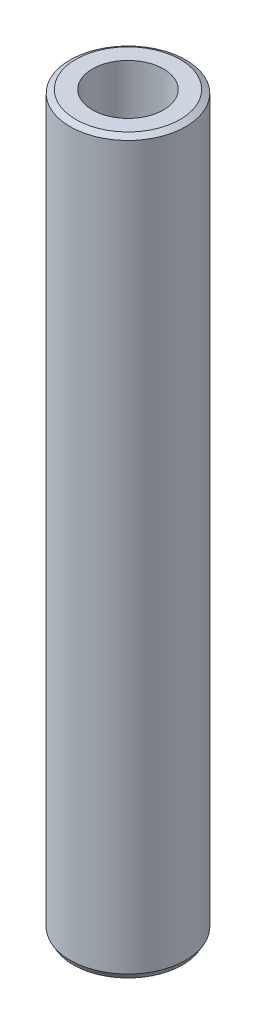
ISO-10303-21;
HEADER;
FILE_DESCRIPTION(('STEP AP214'),'2;1');
FILE_NAME('part.step','',(''),(''),'','','');
FILE_SCHEMA(('AUTOMOTIVE_DESIGN { 1 0 10303 214 1 1 1 1 }'));
ENDSEC;
DATA;
#1=APPLICATION_CONTEXT('core data for automotive mechanical design processes');
#2=APPLICATION_PROTOCOL_DEFINITION('international standard','automotive_design',2000,#1);
#3=PRODUCT_CONTEXT('',#1,'mechanical');
#4=PRODUCT('Part','Part','',(#3));
#5=PRODUCT_RELATED_PRODUCT_CATEGORY('part','',(#4));
#6=PRODUCT_DEFINITION_FORMATION('','',#4);
#7=PRODUCT_DEFINITION_CONTEXT('part definition',#1,'design');
#8=PRODUCT_DEFINITION('design','',#6,#7);
#9=PRODUCT_DEFINITION_SHAPE('','',#8);
#10=(LENGTH_UNIT() NAMED_UNIT(*) SI_UNIT(.MILLI.,.METRE.));
#11=(NAMED_UNIT(*) PLANE_ANGLE_UNIT() SI_UNIT($,.RADIAN.));
#12=(NAMED_UNIT(*) SI_UNIT($,.STERADIAN.) SOLID_ANGLE_UNIT());
#13=UNCERTAINTY_MEASURE_WITH_UNIT(LENGTH_MEASURE(1.E-05),#10,'distance_accuracy_value','');
#14=(GEOMETRIC_REPRESENTATION_CONTEXT(3) GLOBAL_UNCERTAINTY_ASSIGNED_CONTEXT((#13)) GLOBAL_UNIT_ASSIGNED_CONTEXT((#10,
#11,#12)) REPRESENTATION_CONTEXT('',''));
#15=CARTESIAN_POINT('',(0.,0.,0.));
#16=DIRECTION('',(0.,0.,1.));
#17=DIRECTION('',(1.,0.,0.));
#18=AXIS2_PLACEMENT_3D('',#15,#16,#17);
#19=CARTESIAN_POINT('',(0.,600.,0.));
#20=DIRECTION('',(0.,-1.,0.));
#21=DIRECTION('',(0.,0.,-1.));
#22=AXIS2_PLACEMENT_3D('',#19,#20,#21);
#23=CYLINDRICAL_SURFACE('',#22,47.5);
#24=CARTESIAN_POINT('',(0.,597.283650292366,0.));
#25=DIRECTION('',(0.,1.,0.));
#26=DIRECTION('',(0.,0.,1.));
#27=AXIS2_PLACEMENT_3D('',#24,#25,#26);
#28=CIRCLE('',#27,47.5);
#29=CARTESIAN_POINT('',(0.,597.283650292366,47.5));
#30=VERTEX_POINT('',#29);
#31=EDGE_CURVE('E50',#30,#30,#28,.F.);
#32=ORIENTED_EDGE('',*,*,#31,.T.);
#33=EDGE_LOOP('',(#32));
#34=FACE_BOUND('',#33,.T.);
#35=CARTESIAN_POINT('',(0.,4.7048557047471,0.));
#36=DIRECTION('',(0.,1.,0.));
#37=DIRECTION('',(0.,0.,1.));
#38=AXIS2_PLACEMENT_3D('',#35,#36,#37);
#39=CIRCLE('',#38,47.5);
#40=CARTESIAN_POINT('',(0.,4.7048557047471,47.5));
#41=VERTEX_POINT('',#40);
#42=EDGE_CURVE('E51',#41,#41,#39,.T.);
#43=ORIENTED_EDGE('',*,*,#42,.T.);
#44=EDGE_LOOP('',(#43));
#45=FACE_BOUND('',#44,.T.);
#46=ADVANCED_FACE('F39',(#34,#45),#23,.T.);
#47=CARTESIAN_POINT('',(0.,600.,0.));
#48=DIRECTION('',(0.,1.,0.));
#49=DIRECTION('',(0.,0.,1.));
#50=AXIS2_PLACEMENT_3D('',#47,#48,#49);
#51=PLANE('',#50);
#52=CARTESIAN_POINT('',(0.,600.,0.));
#53=DIRECTION('',(0.,1.,0.));
#54=DIRECTION('',(0.,0.,1.));
#55=AXIS2_PLACEMENT_3D('',#52,#53,#54);
#56=CIRCLE('',#55,42.7951442952524);
#57=CARTESIAN_POINT('',(0.,600.,42.7951442952524));
#58=VERTEX_POINT('',#57);
#59=EDGE_CURVE('E54',#58,#58,#56,.T.);
#60=ORIENTED_EDGE('',*,*,#59,.T.);
#61=EDGE_LOOP('',(#60));
#62=FACE_BOUND('',#61,.T.);
#63=CARTESIAN_POINT('',(0.,600.,0.));
#64=DIRECTION('',(0.,1.,0.));
#65=DIRECTION('',(0.,0.,1.));
#66=AXIS2_PLACEMENT_3D('',#63,#64,#65);
#67=CIRCLE('',#66,29.1758186195127);
#68=CARTESIAN_POINT('',(0.,600.,29.1758186195127));
#69=VERTEX_POINT('',#68);
#70=EDGE_CURVE('E58',#69,#69,#67,.T.);
#71=ORIENTED_EDGE('',*,*,#70,.F.);
#72=EDGE_LOOP('',(#71));
#73=FACE_BOUND('',#72,.T.);
#74=ADVANCED_FACE('F69',(#62,#73),#51,.T.);
#75=CARTESIAN_POINT('',(0.,0.,0.));
#76=DIRECTION('',(0.,1.,0.));
#77=DIRECTION('',(0.,0.,1.));
#78=AXIS2_PLACEMENT_3D('',#75,#76,#77);
#79=PLANE('',#78);
#80=CARTESIAN_POINT('',(0.,0.,0.));
#81=DIRECTION('',(0.,1.,0.));
#82=DIRECTION('',(0.,0.,1.));
#83=AXIS2_PLACEMENT_3D('',#80,#81,#82);
#84=CIRCLE('',#83,44.7836502923659);
#85=CARTESIAN_POINT('',(0.,0.,44.7836502923659));
#86=VERTEX_POINT('',#85);
#87=EDGE_CURVE('E10',#86,#86,#84,.F.);
#88=ORIENTED_EDGE('',*,*,#87,.T.);
#89=EDGE_LOOP('',(#88));
#90=FACE_BOUND('',#89,.T.);
#91=CARTESIAN_POINT('',(0.,0.,0.));
#92=DIRECTION('',(0.,1.,0.));
#93=DIRECTION('',(0.,0.,1.));
#94=AXIS2_PLACEMENT_3D('',#91,#92,#93);
#95=CIRCLE('',#94,29.1758186195127);
#96=CARTESIAN_POINT('',(0.,0.,29.1758186195127));
#97=VERTEX_POINT('',#96);
#98=EDGE_CURVE('E63',#97,#97,#95,.T.);
#99=ORIENTED_EDGE('',*,*,#98,.T.);
#100=EDGE_LOOP('',(#99));
#101=FACE_BOUND('',#100,.T.);
#102=ADVANCED_FACE('F75',(#90,#101),#79,.F.);
#103=CARTESIAN_POINT('',(0.,600.,0.));
#104=DIRECTION('',(0.,-1.,0.));
#105=DIRECTION('',(0.,0.,-1.));
#106=AXIS2_PLACEMENT_3D('',#103,#104,#105);
#107=CYLINDRICAL_SURFACE('',#106,29.1758186195127);
#108=ORIENTED_EDGE('',*,*,#70,.T.);
#109=EDGE_LOOP('',(#108));
#110=FACE_BOUND('',#109,.T.);
#111=ORIENTED_EDGE('',*,*,#98,.F.);
#112=EDGE_LOOP('',(#111));
#113=FACE_BOUND('',#112,.T.);
#114=ADVANCED_FACE('F70',(#110,#113),#107,.F.);
#115=CARTESIAN_POINT('',(0.,600.,0.));
#116=DIRECTION('',(0.,-1.,0.));
#117=DIRECTION('',(0.,0.,-1.));
#118=AXIS2_PLACEMENT_3D('',#115,#116,#117);
#119=CONICAL_SURFACE('',#118,42.7951442952524,1.04719755119658);
#120=ORIENTED_EDGE('',*,*,#31,.F.);
#121=EDGE_LOOP('',(#120));
#122=FACE_BOUND('',#121,.T.);
#123=ORIENTED_EDGE('',*,*,#59,.F.);
#124=EDGE_LOOP('',(#123));
#125=FACE_BOUND('',#124,.T.);
#126=ADVANCED_FACE('F81',(#122,#125),#119,.T.);
#127=CARTESIAN_POINT('',(0.,4.7048557047471,0.));
#128=DIRECTION('',(0.,1.,0.));
#129=DIRECTION('',(0.,0.,1.));
#130=AXIS2_PLACEMENT_3D('',#127,#128,#129);
#131=CONICAL_SURFACE('',#130,47.5,0.523598775598308);
#132=ORIENTED_EDGE('',*,*,#87,.F.);
#133=EDGE_LOOP('',(#132));
#134=FACE_BOUND('',#133,.T.);
#135=ORIENTED_EDGE('',*,*,#42,.F.);
#136=EDGE_LOOP('',(#135));
#137=FACE_BOUND('',#136,.T.);
#138=ADVANCED_FACE('F45',(#134,#137),#131,.T.);
#139=CLOSED_SHELL('',(#46,#74,#102,#114,#126,#138));
#140=MANIFOLD_SOLID_BREP('B2',#139);
#141=ADVANCED_BREP_SHAPE_REPRESENTATION('',(#18,#140),#14);
#142=SHAPE_DEFINITION_REPRESENTATION(#9,#141);
ENDSEC;
END-ISO-10303-21;
